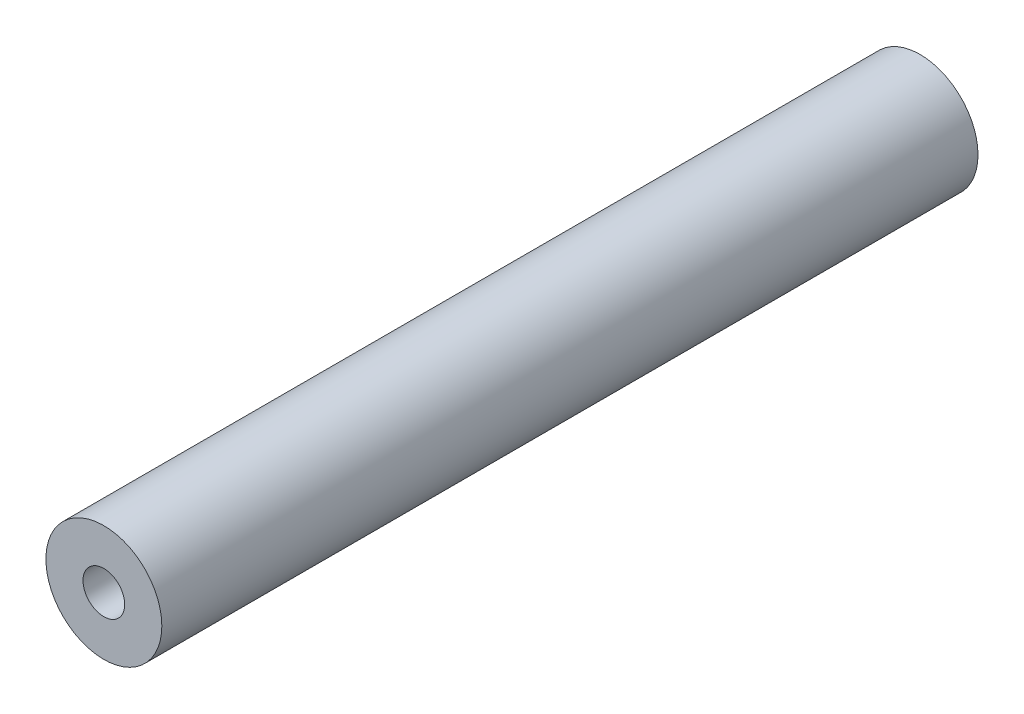
ISO-10303-21;
HEADER;
FILE_DESCRIPTION(('STEP AP214'),'2;1');
FILE_NAME('part.step','',(''),(''),'','','');
FILE_SCHEMA(('AUTOMOTIVE_DESIGN { 1 0 10303 214 1 1 1 1 }'));
ENDSEC;
DATA;
#1=APPLICATION_CONTEXT('core data for automotive mechanical design processes');
#2=APPLICATION_PROTOCOL_DEFINITION('international standard','automotive_design',2000,#1);
#3=PRODUCT_CONTEXT('',#1,'mechanical');
#4=PRODUCT('Part','Part','',(#3));
#5=PRODUCT_RELATED_PRODUCT_CATEGORY('part','',(#4));
#6=PRODUCT_DEFINITION_FORMATION('','',#4);
#7=PRODUCT_DEFINITION_CONTEXT('part definition',#1,'design');
#8=PRODUCT_DEFINITION('design','',#6,#7);
#9=PRODUCT_DEFINITION_SHAPE('','',#8);
#10=(LENGTH_UNIT() NAMED_UNIT(*) SI_UNIT(.MILLI.,.METRE.));
#11=(NAMED_UNIT(*) PLANE_ANGLE_UNIT() SI_UNIT($,.RADIAN.));
#12=(NAMED_UNIT(*) SI_UNIT($,.STERADIAN.) SOLID_ANGLE_UNIT());
#13=UNCERTAINTY_MEASURE_WITH_UNIT(LENGTH_MEASURE(1.E-05),#10,'distance_accuracy_value','');
#14=(GEOMETRIC_REPRESENTATION_CONTEXT(3) GLOBAL_UNCERTAINTY_ASSIGNED_CONTEXT((#13)) GLOBAL_UNIT_ASSIGNED_CONTEXT((#10,
#11,#12)) REPRESENTATION_CONTEXT('',''));
#15=CARTESIAN_POINT('',(0.,0.,0.));
#16=DIRECTION('',(0.,0.,1.));
#17=DIRECTION('',(1.,0.,0.));
#18=AXIS2_PLACEMENT_3D('',#15,#16,#17);
#19=CARTESIAN_POINT('',(0.,0.,447.04));
#20=DIRECTION('',(0.,0.,-1.));
#21=DIRECTION('',(-1.,0.,0.));
#22=AXIS2_PLACEMENT_3D('',#19,#20,#21);
#23=CYLINDRICAL_SURFACE('',#22,31.75);
#24=CARTESIAN_POINT('',(0.,0.,447.04));
#25=DIRECTION('',(0.,0.,1.));
#26=DIRECTION('',(1.,0.,0.));
#27=AXIS2_PLACEMENT_3D('',#24,#25,#26);
#28=CIRCLE('',#27,31.75);
#29=CARTESIAN_POINT('',(31.75,0.,447.04));
#30=VERTEX_POINT('',#29);
#31=EDGE_CURVE('E10',#30,#30,#28,.T.);
#32=ORIENTED_EDGE('',*,*,#31,.F.);
#33=EDGE_LOOP('',(#32));
#34=FACE_BOUND('',#33,.T.);
#35=CARTESIAN_POINT('',(0.,0.,0.));
#36=DIRECTION('',(0.,0.,1.));
#37=DIRECTION('',(1.,0.,0.));
#38=AXIS2_PLACEMENT_3D('',#35,#36,#37);
#39=CIRCLE('',#38,31.75);
#40=CARTESIAN_POINT('',(31.75,0.,0.));
#41=VERTEX_POINT('',#40);
#42=EDGE_CURVE('E34',#41,#41,#39,.T.);
#43=ORIENTED_EDGE('',*,*,#42,.T.);
#44=EDGE_LOOP('',(#43));
#45=FACE_BOUND('',#44,.T.);
#46=ADVANCED_FACE('F31',(#34,#45),#23,.T.);
#47=CARTESIAN_POINT('',(0.,0.,447.04));
#48=DIRECTION('',(0.,0.,1.));
#49=DIRECTION('',(1.,0.,0.));
#50=AXIS2_PLACEMENT_3D('',#47,#48,#49);
#51=PLANE('',#50);
#52=CARTESIAN_POINT('',(0.,0.,447.04));
#53=DIRECTION('',(0.,0.,1.));
#54=DIRECTION('',(1.,0.,0.));
#55=AXIS2_PLACEMENT_3D('',#52,#53,#54);
#56=CIRCLE('',#55,11.43);
#57=CARTESIAN_POINT('',(11.43,0.,447.04));
#58=VERTEX_POINT('',#57);
#59=EDGE_CURVE('E43',#58,#58,#56,.T.);
#60=ORIENTED_EDGE('',*,*,#59,.F.);
#61=EDGE_LOOP('',(#60));
#62=FACE_BOUND('',#61,.T.);
#63=ORIENTED_EDGE('',*,*,#31,.T.);
#64=EDGE_LOOP('',(#63));
#65=FACE_BOUND('',#64,.T.);
#66=ADVANCED_FACE('F58',(#62,#65),#51,.T.);
#67=CARTESIAN_POINT('',(0.,0.,0.));
#68=DIRECTION('',(0.,0.,1.));
#69=DIRECTION('',(1.,0.,0.));
#70=AXIS2_PLACEMENT_3D('',#67,#68,#69);
#71=PLANE('',#70);
#72=CARTESIAN_POINT('',(0.,0.,0.));
#73=DIRECTION('',(0.,0.,1.));
#74=DIRECTION('',(1.,0.,0.));
#75=AXIS2_PLACEMENT_3D('',#72,#73,#74);
#76=CIRCLE('',#75,11.43);
#77=CARTESIAN_POINT('',(11.43,0.,0.));
#78=VERTEX_POINT('',#77);
#79=EDGE_CURVE('E41',#78,#78,#76,.T.);
#80=ORIENTED_EDGE('',*,*,#79,.T.);
#81=EDGE_LOOP('',(#80));
#82=FACE_BOUND('',#81,.T.);
#83=ORIENTED_EDGE('',*,*,#42,.F.);
#84=EDGE_LOOP('',(#83));
#85=FACE_BOUND('',#84,.T.);
#86=ADVANCED_FACE('F49',(#82,#85),#71,.F.);
#87=CARTESIAN_POINT('',(0.,0.,0.));
#88=DIRECTION('',(0.,0.,1.));
#89=DIRECTION('',(1.,0.,0.));
#90=AXIS2_PLACEMENT_3D('',#87,#88,#89);
#91=CYLINDRICAL_SURFACE('',#90,11.43);
#92=ORIENTED_EDGE('',*,*,#79,.F.);
#93=EDGE_LOOP('',(#92));
#94=FACE_BOUND('',#93,.T.);
#95=ORIENTED_EDGE('',*,*,#59,.T.);
#96=EDGE_LOOP('',(#95));
#97=FACE_BOUND('',#96,.T.);
#98=ADVANCED_FACE('F52',(#94,#97),#91,.F.);
#99=CLOSED_SHELL('',(#46,#66,#86,#98));
#100=MANIFOLD_SOLID_BREP('B2',#99);
#101=ADVANCED_BREP_SHAPE_REPRESENTATION('',(#18,#100),#14);
#102=SHAPE_DEFINITION_REPRESENTATION(#9,#101);
ENDSEC;
END-ISO-10303-21;
